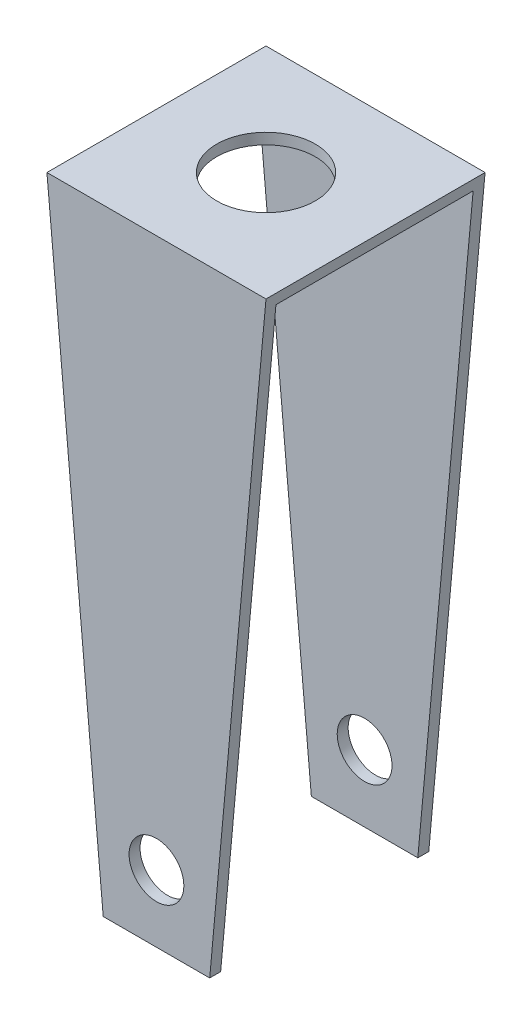
ISO-10303-21;
HEADER;
FILE_DESCRIPTION(('STEP AP214'),'2;1');
FILE_NAME('part.step','',(''),(''),'','','');
FILE_SCHEMA(('AUTOMOTIVE_DESIGN { 1 0 10303 214 1 1 1 1 }'));
ENDSEC;
DATA;
#1=APPLICATION_CONTEXT('core data for automotive mechanical design processes');
#2=APPLICATION_PROTOCOL_DEFINITION('international standard','automotive_design',2000,#1);
#3=PRODUCT_CONTEXT('',#1,'mechanical');
#4=PRODUCT('Part','Part','',(#3));
#5=PRODUCT_RELATED_PRODUCT_CATEGORY('part','',(#4));
#6=PRODUCT_DEFINITION_FORMATION('','',#4);
#7=PRODUCT_DEFINITION_CONTEXT('part definition',#1,'design');
#8=PRODUCT_DEFINITION('design','',#6,#7);
#9=PRODUCT_DEFINITION_SHAPE('','',#8);
#10=(LENGTH_UNIT() NAMED_UNIT(*) SI_UNIT(.MILLI.,.METRE.));
#11=(NAMED_UNIT(*) PLANE_ANGLE_UNIT() SI_UNIT($,.RADIAN.));
#12=(NAMED_UNIT(*) SI_UNIT($,.STERADIAN.) SOLID_ANGLE_UNIT());
#13=UNCERTAINTY_MEASURE_WITH_UNIT(LENGTH_MEASURE(1.E-05),#10,'distance_accuracy_value','');
#14=(GEOMETRIC_REPRESENTATION_CONTEXT(3) GLOBAL_UNCERTAINTY_ASSIGNED_CONTEXT((#13)) GLOBAL_UNIT_ASSIGNED_CONTEXT((#10,
#11,#12)) REPRESENTATION_CONTEXT('',''));
#15=CARTESIAN_POINT('',(0.,0.,0.));
#16=DIRECTION('',(0.,0.,1.));
#17=DIRECTION('',(1.,0.,0.));
#18=AXIS2_PLACEMENT_3D('',#15,#16,#17);
#19=CARTESIAN_POINT('',(2.,-2.59760956175299,-0.9));
#20=DIRECTION('',(0.,0.,-1.));
#21=DIRECTION('',(-1.,0.,0.));
#22=AXIS2_PLACEMENT_3D('',#19,#20,#21);
#23=PLANE('',#22);
#24=CARTESIAN_POINT('',(1.,-1.98702579393159,-0.9));
#25=DIRECTION('',(0.,0.,-1.));
#26=DIRECTION('',(-1.,0.,0.));
#27=AXIS2_PLACEMENT_3D('',#24,#25,#26);
#28=CIRCLE('',#27,0.25);
#29=CARTESIAN_POINT('',(0.75,-1.98702579393159,-0.9));
#30=VERTEX_POINT('',#29);
#31=EDGE_CURVE('E125',#30,#30,#28,.T.);
#32=ORIENTED_EDGE('',*,*,#31,.T.);
#33=EDGE_LOOP('',(#32));
#34=FACE_BOUND('',#33,.T.);
#35=DIRECTION('',(-1.,0.,0.));
#36=VECTOR('',#35,1.);
#37=CARTESIAN_POINT('',(2.,2.92788844621514,-0.9));
#38=LINE('',#37,#36);
#39=CARTESIAN_POINT('',(1.99086335473827,2.92788844621514,-0.900000000000001));
#40=VERTEX_POINT('',#39);
#41=CARTESIAN_POINT('',(0.00913664526173323,2.92788844621514,-0.900000000000001));
#42=VERTEX_POINT('',#41);
#43=EDGE_CURVE('E166',#40,#42,#38,.T.);
#44=ORIENTED_EDGE('',*,*,#43,.T.);
#45=DIRECTION('',(0.0909874680015043,-0.995852037537041,0.));
#46=VECTOR('',#45,1.);
#47=CARTESIAN_POINT('',(0.526284124819174,-2.73225775343411,-0.9));
#48=LINE('',#47,#46);
#49=CARTESIAN_POINT('',(0.513981797193931,-2.59760956175299,-0.9));
#50=VERTEX_POINT('',#49);
#51=EDGE_CURVE('E153',#42,#50,#48,.T.);
#52=ORIENTED_EDGE('',*,*,#51,.T.);
#53=DIRECTION('',(-1.,0.,0.));
#54=VECTOR('',#53,1.);
#55=CARTESIAN_POINT('',(2.,-2.59760956175299,-0.9));
#56=LINE('',#55,#54);
#57=CARTESIAN_POINT('',(1.48601820280607,-2.59760956175299,-0.9));
#58=VERTEX_POINT('',#57);
#59=EDGE_CURVE('E11',#58,#50,#56,.T.);
#60=ORIENTED_EDGE('',*,*,#59,.F.);
#61=DIRECTION('',(0.0909874680015043,0.995852037537041,0.));
#62=VECTOR('',#61,1.);
#63=CARTESIAN_POINT('',(1.49027331384748,-2.55103764263484,-0.9));
#64=LINE('',#63,#62);
#65=EDGE_CURVE('E161',#58,#40,#64,.T.);
#66=ORIENTED_EDGE('',*,*,#65,.T.);
#67=EDGE_LOOP('',(#44,#52,#60,#66));
#68=FACE_BOUND('',#67,.T.);
#69=ADVANCED_FACE('F36',(#34,#68),#23,.F.);
#70=CARTESIAN_POINT('',(2.,-2.59760956175299,-0.9));
#71=DIRECTION('',(0.,1.,0.));
#72=DIRECTION('',(0.,0.,1.));
#73=AXIS2_PLACEMENT_3D('',#70,#71,#72);
#74=PLANE('',#73);
#75=ORIENTED_EDGE('',*,*,#59,.T.);
#76=DIRECTION('',(0.,0.,1.));
#77=VECTOR('',#76,1.);
#78=CARTESIAN_POINT('',(0.513981797193931,-2.59760956175299,-1.));
#79=LINE('',#78,#77);
#80=CARTESIAN_POINT('',(0.513981797193931,-2.59760956175299,-1.));
#81=VERTEX_POINT('',#80);
#82=EDGE_CURVE('E100',#81,#50,#79,.T.);
#83=ORIENTED_EDGE('',*,*,#82,.F.);
#84=DIRECTION('',(-1.,0.,0.));
#85=VECTOR('',#84,1.);
#86=CARTESIAN_POINT('',(2.,-2.59760956175299,-1.));
#87=LINE('',#86,#85);
#88=CARTESIAN_POINT('',(1.48601820280607,-2.59760956175299,-1.));
#89=VERTEX_POINT('',#88);
#90=EDGE_CURVE('E45',#89,#81,#87,.T.);
#91=ORIENTED_EDGE('',*,*,#90,.F.);
#92=DIRECTION('',(0.,0.,1.));
#93=VECTOR('',#92,1.);
#94=CARTESIAN_POINT('',(1.48601820280607,-2.59760956175299,-1.));
#95=LINE('',#94,#93);
#96=EDGE_CURVE('E144',#89,#58,#95,.T.);
#97=ORIENTED_EDGE('',*,*,#96,.T.);
#98=EDGE_LOOP('',(#75,#83,#91,#97));
#99=FACE_BOUND('',#98,.T.);
#100=ADVANCED_FACE('F112',(#99),#74,.F.);
#101=CARTESIAN_POINT('',(2.,-2.59760956175299,-1.));
#102=DIRECTION('',(0.,0.,1.));
#103=DIRECTION('',(1.,0.,0.));
#104=AXIS2_PLACEMENT_3D('',#101,#102,#103);
#105=PLANE('',#104);
#106=CARTESIAN_POINT('',(1.,-1.98702579393159,-1.));
#107=DIRECTION('',(0.,0.,1.));
#108=DIRECTION('',(1.,0.,0.));
#109=AXIS2_PLACEMENT_3D('',#106,#107,#108);
#110=CIRCLE('',#109,0.25);
#111=CARTESIAN_POINT('',(1.25,-1.98702579393159,-1.));
#112=VERTEX_POINT('',#111);
#113=EDGE_CURVE('E126',#112,#112,#110,.T.);
#114=ORIENTED_EDGE('',*,*,#113,.T.);
#115=EDGE_LOOP('',(#114));
#116=FACE_BOUND('',#115,.T.);
#117=ORIENTED_EDGE('',*,*,#90,.T.);
#118=DIRECTION('',(-0.0909874680015043,0.99585203753704,0.));
#119=VECTOR('',#118,1.);
#120=CARTESIAN_POINT('',(0.,3.02788844621514,-1.));
#121=LINE('',#120,#119);
#122=CARTESIAN_POINT('',(0.,3.02788844621514,-1.));
#123=VERTEX_POINT('',#122);
#124=EDGE_CURVE('E97',#81,#123,#121,.T.);
#125=ORIENTED_EDGE('',*,*,#124,.T.);
#126=DIRECTION('',(-1.,0.,0.));
#127=VECTOR('',#126,1.);
#128=CARTESIAN_POINT('',(2.,3.02788844621514,-1.));
#129=LINE('',#128,#127);
#130=CARTESIAN_POINT('',(2.,3.02788844621514,-1.));
#131=VERTEX_POINT('',#130);
#132=EDGE_CURVE('E118',#131,#123,#129,.T.);
#133=ORIENTED_EDGE('',*,*,#132,.F.);
#134=DIRECTION('',(-0.0909874680015043,-0.99585203753704,0.));
#135=VECTOR('',#134,1.);
#136=CARTESIAN_POINT('',(2.,3.02788844621514,-1.));
#137=LINE('',#136,#135);
#138=EDGE_CURVE('E52',#131,#89,#137,.T.);
#139=ORIENTED_EDGE('',*,*,#138,.T.);
#140=EDGE_LOOP('',(#117,#125,#133,#139));
#141=FACE_BOUND('',#140,.T.);
#142=ADVANCED_FACE('F117',(#116,#141),#105,.F.);
#143=CARTESIAN_POINT('',(2.,3.02788844621514,1.));
#144=DIRECTION('',(0.,-1.,0.));
#145=DIRECTION('',(0.,0.,-1.));
#146=AXIS2_PLACEMENT_3D('',#143,#144,#145);
#147=PLANE('',#146);
#148=CARTESIAN_POINT('',(1.,3.02788844621514,0.));
#149=DIRECTION('',(0.,1.,0.));
#150=DIRECTION('',(0.,0.,1.));
#151=AXIS2_PLACEMENT_3D('',#148,#149,#150);
#152=CIRCLE('',#151,0.45);
#153=CARTESIAN_POINT('',(1.,3.02788844621514,0.45));
#154=VERTEX_POINT('',#153);
#155=EDGE_CURVE('E140',#154,#154,#152,.T.);
#156=ORIENTED_EDGE('',*,*,#155,.F.);
#157=EDGE_LOOP('',(#156));
#158=FACE_BOUND('',#157,.T.);
#159=DIRECTION('',(0.,0.,1.));
#160=VECTOR('',#159,1.);
#161=CARTESIAN_POINT('',(0.,3.02788844621514,1.));
#162=LINE('',#161,#160);
#163=CARTESIAN_POINT('',(0.,3.02788844621514,1.));
#164=VERTEX_POINT('',#163);
#165=EDGE_CURVE('E103',#123,#164,#162,.T.);
#166=ORIENTED_EDGE('',*,*,#165,.T.);
#167=DIRECTION('',(-1.,0.,0.));
#168=VECTOR('',#167,1.);
#169=CARTESIAN_POINT('',(2.,3.02788844621514,1.));
#170=LINE('',#169,#168);
#171=CARTESIAN_POINT('',(2.,3.02788844621514,1.));
#172=VERTEX_POINT('',#171);
#173=EDGE_CURVE('E120',#172,#164,#170,.T.);
#174=ORIENTED_EDGE('',*,*,#173,.F.);
#175=DIRECTION('',(0.,0.,1.));
#176=VECTOR('',#175,1.);
#177=CARTESIAN_POINT('',(2.,3.02788844621514,1.));
#178=LINE('',#177,#176);
#179=EDGE_CURVE('E164',#131,#172,#178,.T.);
#180=ORIENTED_EDGE('',*,*,#179,.F.);
#181=ORIENTED_EDGE('',*,*,#132,.T.);
#182=EDGE_LOOP('',(#166,#174,#180,#181));
#183=FACE_BOUND('',#182,.T.);
#184=ADVANCED_FACE('F187',(#158,#183),#147,.F.);
#185=CARTESIAN_POINT('',(2.,-2.59760956175299,1.));
#186=DIRECTION('',(0.,0.,-1.));
#187=DIRECTION('',(-1.,0.,0.));
#188=AXIS2_PLACEMENT_3D('',#185,#186,#187);
#189=PLANE('',#188);
#190=CARTESIAN_POINT('',(1.,-1.98702579393159,1.));
#191=DIRECTION('',(0.,0.,1.));
#192=DIRECTION('',(1.,0.,0.));
#193=AXIS2_PLACEMENT_3D('',#190,#191,#192);
#194=CIRCLE('',#193,0.25);
#195=CARTESIAN_POINT('',(1.25,-1.98702579393159,1.));
#196=VERTEX_POINT('',#195);
#197=EDGE_CURVE('E133',#196,#196,#194,.T.);
#198=ORIENTED_EDGE('',*,*,#197,.F.);
#199=EDGE_LOOP('',(#198));
#200=FACE_BOUND('',#199,.T.);
#201=ORIENTED_EDGE('',*,*,#173,.T.);
#202=DIRECTION('',(-0.0909874680015043,0.99585203753704,0.));
#203=VECTOR('',#202,1.);
#204=CARTESIAN_POINT('',(0.,3.02788844621514,1.));
#205=LINE('',#204,#203);
#206=CARTESIAN_POINT('',(0.513981797193931,-2.59760956175299,1.));
#207=VERTEX_POINT('',#206);
#208=EDGE_CURVE('E108',#207,#164,#205,.T.);
#209=ORIENTED_EDGE('',*,*,#208,.F.);
#210=DIRECTION('',(-1.,0.,0.));
#211=VECTOR('',#210,1.);
#212=CARTESIAN_POINT('',(2.,-2.59760956175299,1.));
#213=LINE('',#212,#211);
#214=CARTESIAN_POINT('',(1.48601820280607,-2.59760956175299,1.));
#215=VERTEX_POINT('',#214);
#216=EDGE_CURVE('E176',#215,#207,#213,.T.);
#217=ORIENTED_EDGE('',*,*,#216,.F.);
#218=DIRECTION('',(-0.0909874680015043,-0.99585203753704,0.));
#219=VECTOR('',#218,1.);
#220=CARTESIAN_POINT('',(2.,3.02788844621514,1.));
#221=LINE('',#220,#219);
#222=EDGE_CURVE('E142',#172,#215,#221,.T.);
#223=ORIENTED_EDGE('',*,*,#222,.F.);
#224=EDGE_LOOP('',(#201,#209,#217,#223));
#225=FACE_BOUND('',#224,.T.);
#226=ADVANCED_FACE('F183',(#200,#225),#189,.F.);
#227=CARTESIAN_POINT('',(2.,-2.59760956175299,0.899999999999999));
#228=DIRECTION('',(0.,1.,0.));
#229=DIRECTION('',(0.,0.,1.));
#230=AXIS2_PLACEMENT_3D('',#227,#228,#229);
#231=PLANE('',#230);
#232=ORIENTED_EDGE('',*,*,#216,.T.);
#233=CARTESIAN_POINT('',(0.513981797193931,-2.59760956175299,0.899999999999999));
#234=VERTEX_POINT('',#233);
#235=EDGE_CURVE('E107',#234,#207,#79,.T.);
#236=ORIENTED_EDGE('',*,*,#235,.F.);
#237=DIRECTION('',(-1.,0.,0.));
#238=VECTOR('',#237,1.);
#239=CARTESIAN_POINT('',(2.,-2.59760956175299,0.899999999999999));
#240=LINE('',#239,#238);
#241=CARTESIAN_POINT('',(1.48601820280607,-2.59760956175299,0.899999999999999));
#242=VERTEX_POINT('',#241);
#243=EDGE_CURVE('E173',#242,#234,#240,.T.);
#244=ORIENTED_EDGE('',*,*,#243,.F.);
#245=EDGE_CURVE('E130',#242,#215,#95,.T.);
#246=ORIENTED_EDGE('',*,*,#245,.T.);
#247=EDGE_LOOP('',(#232,#236,#244,#246));
#248=FACE_BOUND('',#247,.T.);
#249=ADVANCED_FACE('F192',(#248),#231,.F.);
#250=CARTESIAN_POINT('',(2.,-2.59760956175299,0.899999999999999));
#251=DIRECTION('',(0.,0.,1.));
#252=DIRECTION('',(1.,0.,0.));
#253=AXIS2_PLACEMENT_3D('',#250,#251,#252);
#254=PLANE('',#253);
#255=CARTESIAN_POINT('',(1.,-1.98702579393159,0.899999999999999));
#256=DIRECTION('',(0.,0.,1.));
#257=DIRECTION('',(1.,0.,0.));
#258=AXIS2_PLACEMENT_3D('',#255,#256,#257);
#259=CIRCLE('',#258,0.25);
#260=CARTESIAN_POINT('',(1.25,-1.98702579393159,0.899999999999999));
#261=VERTEX_POINT('',#260);
#262=EDGE_CURVE('E123',#261,#261,#259,.T.);
#263=ORIENTED_EDGE('',*,*,#262,.T.);
#264=EDGE_LOOP('',(#263));
#265=FACE_BOUND('',#264,.T.);
#266=ORIENTED_EDGE('',*,*,#243,.T.);
#267=DIRECTION('',(-0.0909874680015043,0.995852037537041,0.));
#268=VECTOR('',#267,1.);
#269=CARTESIAN_POINT('',(0.526284124819174,-2.73225775343411,0.899999999999999));
#270=LINE('',#269,#268);
#271=CARTESIAN_POINT('',(0.00913664526173323,2.92788844621514,0.899999999999999));
#272=VERTEX_POINT('',#271);
#273=EDGE_CURVE('E150',#234,#272,#270,.T.);
#274=ORIENTED_EDGE('',*,*,#273,.T.);
#275=DIRECTION('',(-1.,0.,0.));
#276=VECTOR('',#275,1.);
#277=CARTESIAN_POINT('',(2.,2.92788844621514,0.899999999999999));
#278=LINE('',#277,#276);
#279=CARTESIAN_POINT('',(1.99086335473827,2.92788844621514,0.899999999999999));
#280=VERTEX_POINT('',#279);
#281=EDGE_CURVE('E170',#280,#272,#278,.T.);
#282=ORIENTED_EDGE('',*,*,#281,.F.);
#283=DIRECTION('',(-0.0909874680015043,-0.995852037537041,0.));
#284=VECTOR('',#283,1.);
#285=CARTESIAN_POINT('',(1.49027331384748,-2.55103764263484,0.899999999999999));
#286=LINE('',#285,#284);
#287=EDGE_CURVE('E158',#280,#242,#286,.T.);
#288=ORIENTED_EDGE('',*,*,#287,.T.);
#289=EDGE_LOOP('',(#266,#274,#282,#288));
#290=FACE_BOUND('',#289,.T.);
#291=ADVANCED_FACE('F195',(#265,#290),#254,.F.);
#292=CARTESIAN_POINT('',(2.,2.92788844621514,0.899999999999999));
#293=DIRECTION('',(0.,1.,0.));
#294=DIRECTION('',(0.,0.,1.));
#295=AXIS2_PLACEMENT_3D('',#292,#293,#294);
#296=PLANE('',#295);
#297=CARTESIAN_POINT('',(1.,2.92788844621514,0.));
#298=DIRECTION('',(0.,1.,0.));
#299=DIRECTION('',(0.,0.,1.));
#300=AXIS2_PLACEMENT_3D('',#297,#298,#299);
#301=CIRCLE('',#300,0.45);
#302=CARTESIAN_POINT('',(1.,2.92788844621514,0.45));
#303=VERTEX_POINT('',#302);
#304=EDGE_CURVE('E39',#303,#303,#301,.T.);
#305=ORIENTED_EDGE('',*,*,#304,.T.);
#306=EDGE_LOOP('',(#305));
#307=FACE_BOUND('',#306,.T.);
#308=ORIENTED_EDGE('',*,*,#281,.T.);
#309=DIRECTION('',(0.,0.,-1.));
#310=VECTOR('',#309,1.);
#311=CARTESIAN_POINT('',(0.00913664526173323,2.92788844621514,0.899999999999999));
#312=LINE('',#311,#310);
#313=EDGE_CURVE('E115',#272,#42,#312,.T.);
#314=ORIENTED_EDGE('',*,*,#313,.T.);
#315=ORIENTED_EDGE('',*,*,#43,.F.);
#316=DIRECTION('',(0.,0.,1.));
#317=VECTOR('',#316,1.);
#318=CARTESIAN_POINT('',(1.99086335473827,2.92788844621514,0.899999999999999));
#319=LINE('',#318,#317);
#320=EDGE_CURVE('E155',#40,#280,#319,.T.);
#321=ORIENTED_EDGE('',*,*,#320,.T.);
#322=EDGE_LOOP('',(#308,#314,#315,#321));
#323=FACE_BOUND('',#322,.T.);
#324=ADVANCED_FACE('F199',(#307,#323),#296,.F.);
#325=CARTESIAN_POINT('',(0.,3.02788844621514,-1.));
#326=DIRECTION('',(0.995852037537041,0.0909874680015043,0.));
#327=DIRECTION('',(-0.0909874680015043,0.995852037537041,0.));
#328=AXIS2_PLACEMENT_3D('',#325,#326,#327);
#329=PLANE('',#328);
#330=ORIENTED_EDGE('',*,*,#313,.F.);
#331=ORIENTED_EDGE('',*,*,#273,.F.);
#332=ORIENTED_EDGE('',*,*,#235,.T.);
#333=ORIENTED_EDGE('',*,*,#208,.T.);
#334=ORIENTED_EDGE('',*,*,#165,.F.);
#335=ORIENTED_EDGE('',*,*,#124,.F.);
#336=ORIENTED_EDGE('',*,*,#82,.T.);
#337=ORIENTED_EDGE('',*,*,#51,.F.);
#338=EDGE_LOOP('',(#330,#331,#332,#333,#334,#335,#336,#337));
#339=FACE_BOUND('',#338,.T.);
#340=ADVANCED_FACE('F99',(#339),#329,.F.);
#341=CARTESIAN_POINT('',(2.,3.02788844621514,-1.));
#342=DIRECTION('',(-0.995852037537041,0.0909874680015043,0.));
#343=DIRECTION('',(-0.0909874680015043,-0.995852037537041,0.));
#344=AXIS2_PLACEMENT_3D('',#341,#342,#343);
#345=PLANE('',#344);
#346=ORIENTED_EDGE('',*,*,#96,.F.);
#347=ORIENTED_EDGE('',*,*,#138,.F.);
#348=ORIENTED_EDGE('',*,*,#179,.T.);
#349=ORIENTED_EDGE('',*,*,#222,.T.);
#350=ORIENTED_EDGE('',*,*,#245,.F.);
#351=ORIENTED_EDGE('',*,*,#287,.F.);
#352=ORIENTED_EDGE('',*,*,#320,.F.);
#353=ORIENTED_EDGE('',*,*,#65,.F.);
#354=EDGE_LOOP('',(#346,#347,#348,#349,#350,#351,#352,#353));
#355=FACE_BOUND('',#354,.T.);
#356=ADVANCED_FACE('F188',(#355),#345,.F.);
#357=CARTESIAN_POINT('',(1.,-1.98702579393159,-1.));
#358=DIRECTION('',(0.,0.,1.));
#359=DIRECTION('',(1.,0.,0.));
#360=AXIS2_PLACEMENT_3D('',#357,#358,#359);
#361=CYLINDRICAL_SURFACE('',#360,0.25);
#362=ORIENTED_EDGE('',*,*,#197,.T.);
#363=EDGE_LOOP('',(#362));
#364=FACE_BOUND('',#363,.T.);
#365=ORIENTED_EDGE('',*,*,#262,.F.);
#366=EDGE_LOOP('',(#365));
#367=FACE_BOUND('',#366,.T.);
#368=ADVANCED_FACE('F211',(#364,#367),#361,.F.);
#369=ORIENTED_EDGE('',*,*,#113,.F.);
#370=EDGE_LOOP('',(#369));
#371=FACE_BOUND('',#370,.T.);
#372=ORIENTED_EDGE('',*,*,#31,.F.);
#373=EDGE_LOOP('',(#372));
#374=FACE_BOUND('',#373,.T.);
#375=ADVANCED_FACE('F208',(#371,#374),#361,.F.);
#376=CARTESIAN_POINT('',(1.,1.02788844621514,0.));
#377=DIRECTION('',(0.,1.,0.));
#378=DIRECTION('',(0.,0.,1.));
#379=AXIS2_PLACEMENT_3D('',#376,#377,#378);
#380=CYLINDRICAL_SURFACE('',#379,0.45);
#381=ORIENTED_EDGE('',*,*,#155,.T.);
#382=EDGE_LOOP('',(#381));
#383=FACE_BOUND('',#382,.T.);
#384=ORIENTED_EDGE('',*,*,#304,.F.);
#385=EDGE_LOOP('',(#384));
#386=FACE_BOUND('',#385,.T.);
#387=ADVANCED_FACE('F210',(#383,#386),#380,.F.);
#388=CLOSED_SHELL('',(#69,#100,#142,#184,#226,#249,#291,#324,#340,#356,#368,#375,#387));
#389=MANIFOLD_SOLID_BREP('B2',#388);
#390=ADVANCED_BREP_SHAPE_REPRESENTATION('',(#18,#389),#14);
#391=SHAPE_DEFINITION_REPRESENTATION(#9,#390);
ENDSEC;
END-ISO-10303-21;
